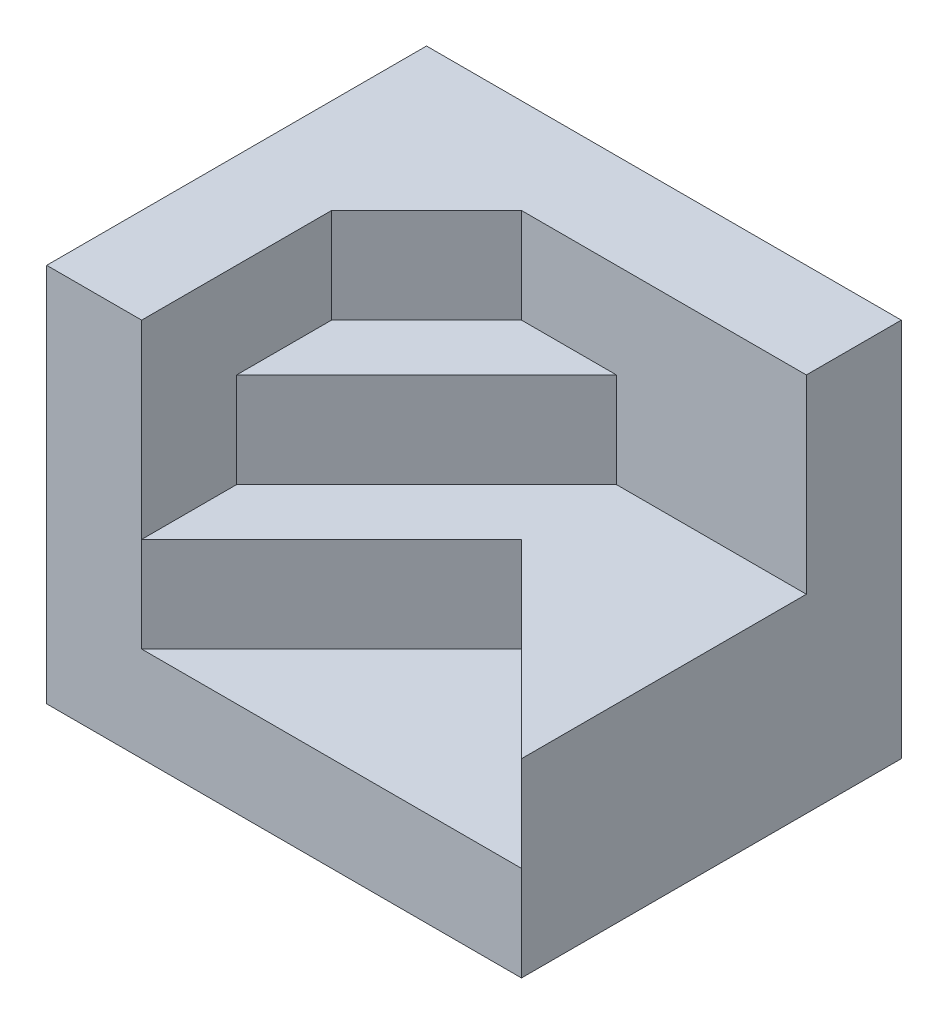
ISO-10303-21;
HEADER;
FILE_DESCRIPTION(('STEP AP214'),'2;1');
FILE_NAME('part.step','',(''),(''),'','','');
FILE_SCHEMA(('AUTOMOTIVE_DESIGN { 1 0 10303 214 1 1 1 1 }'));
ENDSEC;
DATA;
#1=APPLICATION_CONTEXT('core data for automotive mechanical design processes');
#2=APPLICATION_PROTOCOL_DEFINITION('international standard','automotive_design',2000,#1);
#3=PRODUCT_CONTEXT('',#1,'mechanical');
#4=PRODUCT('Part','Part','',(#3));
#5=PRODUCT_RELATED_PRODUCT_CATEGORY('part','',(#4));
#6=PRODUCT_DEFINITION_FORMATION('','',#4);
#7=PRODUCT_DEFINITION_CONTEXT('part definition',#1,'design');
#8=PRODUCT_DEFINITION('design','',#6,#7);
#9=PRODUCT_DEFINITION_SHAPE('','',#8);
#10=(LENGTH_UNIT() NAMED_UNIT(*) SI_UNIT(.MILLI.,.METRE.));
#11=(NAMED_UNIT(*) PLANE_ANGLE_UNIT() SI_UNIT($,.RADIAN.));
#12=(NAMED_UNIT(*) SI_UNIT($,.STERADIAN.) SOLID_ANGLE_UNIT());
#13=UNCERTAINTY_MEASURE_WITH_UNIT(LENGTH_MEASURE(1.E-05),#10,'distance_accuracy_value','');
#14=(GEOMETRIC_REPRESENTATION_CONTEXT(3) GLOBAL_UNCERTAINTY_ASSIGNED_CONTEXT((#13)) GLOBAL_UNIT_ASSIGNED_CONTEXT((#10,
#11,#12)) REPRESENTATION_CONTEXT('',''));
#15=CARTESIAN_POINT('',(0.,0.,0.));
#16=DIRECTION('',(0.,0.,1.));
#17=DIRECTION('',(1.,0.,0.));
#18=AXIS2_PLACEMENT_3D('',#15,#16,#17);
#19=CARTESIAN_POINT('',(0.,10.,0.));
#20=DIRECTION('',(0.,0.,1.));
#21=DIRECTION('',(1.,0.,0.));
#22=AXIS2_PLACEMENT_3D('',#19,#20,#21);
#23=PLANE('',#22);
#24=DIRECTION('',(-1.,0.,0.));
#25=VECTOR('',#24,1.);
#26=CARTESIAN_POINT('',(0.,0.,0.));
#27=LINE('',#26,#25);
#28=CARTESIAN_POINT('',(50.,0.,0.));
#29=VERTEX_POINT('',#28);
#30=CARTESIAN_POINT('',(0.,0.,0.));
#31=VERTEX_POINT('',#30);
#32=EDGE_CURVE('E191',#29,#31,#27,.T.);
#33=ORIENTED_EDGE('',*,*,#32,.F.);
#34=DIRECTION('',(0.,-1.,0.));
#35=VECTOR('',#34,1.);
#36=CARTESIAN_POINT('',(50.,10.,0.));
#37=LINE('',#36,#35);
#38=CARTESIAN_POINT('',(50.,10.,0.));
#39=VERTEX_POINT('',#38);
#40=EDGE_CURVE('E11',#39,#29,#37,.T.);
#41=ORIENTED_EDGE('',*,*,#40,.F.);
#42=DIRECTION('',(-1.,0.,0.));
#43=VECTOR('',#42,1.);
#44=CARTESIAN_POINT('',(0.,10.,0.));
#45=LINE('',#44,#43);
#46=CARTESIAN_POINT('',(10.,10.,0.));
#47=VERTEX_POINT('',#46);
#48=EDGE_CURVE('E40',#39,#47,#45,.T.);
#49=ORIENTED_EDGE('',*,*,#48,.T.);
#50=DIRECTION('',(0.,-1.,0.));
#51=VECTOR('',#50,1.);
#52=CARTESIAN_POINT('',(10.,20.,0.));
#53=LINE('',#52,#51);
#54=CARTESIAN_POINT('',(10.,20.,0.));
#55=VERTEX_POINT('',#54);
#56=EDGE_CURVE('E183',#55,#47,#53,.T.);
#57=ORIENTED_EDGE('',*,*,#56,.F.);
#58=DIRECTION('',(0.,-1.,0.));
#59=VECTOR('',#58,1.);
#60=CARTESIAN_POINT('',(10.,40.,0.));
#61=LINE('',#60,#59);
#62=CARTESIAN_POINT('',(10.,40.,0.));
#63=VERTEX_POINT('',#62);
#64=EDGE_CURVE('E210',#63,#55,#61,.T.);
#65=ORIENTED_EDGE('',*,*,#64,.F.);
#66=DIRECTION('',(-1.,0.,0.));
#67=VECTOR('',#66,1.);
#68=CARTESIAN_POINT('',(0.,40.,0.));
#69=LINE('',#68,#67);
#70=CARTESIAN_POINT('',(0.,40.,0.));
#71=VERTEX_POINT('',#70);
#72=EDGE_CURVE('E205',#63,#71,#69,.T.);
#73=ORIENTED_EDGE('',*,*,#72,.T.);
#74=DIRECTION('',(0.,-1.,0.));
#75=VECTOR('',#74,1.);
#76=CARTESIAN_POINT('',(0.,40.,0.));
#77=LINE('',#76,#75);
#78=EDGE_CURVE('E204',#71,#31,#77,.T.);
#79=ORIENTED_EDGE('',*,*,#78,.T.);
#80=EDGE_LOOP('',(#33,#41,#49,#57,#65,#73,#79));
#81=FACE_BOUND('',#80,.T.);
#82=ADVANCED_FACE('F33',(#81),#23,.T.);
#83=CARTESIAN_POINT('',(0.,10.,0.));
#84=DIRECTION('',(0.,1.,0.));
#85=DIRECTION('',(0.,0.,1.));
#86=AXIS2_PLACEMENT_3D('',#83,#84,#85);
#87=PLANE('',#86);
#88=DIRECTION('',(0.707106781186551,0.,0.707106781186544));
#89=VECTOR('',#88,1.);
#90=CARTESIAN_POINT('',(24.9999999999997,10.,-25.));
#91=LINE('',#90,#89);
#92=CARTESIAN_POINT('',(29.9999999999998,10.,-20.));
#93=VERTEX_POINT('',#92);
#94=EDGE_CURVE('E192',#93,#39,#91,.T.);
#95=ORIENTED_EDGE('',*,*,#94,.F.);
#96=DIRECTION('',(0.707106781186551,0.,-0.707106781186544));
#97=VECTOR('',#96,1.);
#98=CARTESIAN_POINT('',(4.99999999999974,10.,4.99999999999979));
#99=LINE('',#98,#97);
#100=EDGE_CURVE('E54',#47,#93,#99,.T.);
#101=ORIENTED_EDGE('',*,*,#100,.F.);
#102=ORIENTED_EDGE('',*,*,#48,.F.);
#103=EDGE_LOOP('',(#95,#101,#102));
#104=FACE_BOUND('',#103,.T.);
#105=ADVANCED_FACE('F241',(#104),#87,.T.);
#106=CARTESIAN_POINT('',(0.,0.,0.));
#107=DIRECTION('',(0.,1.,0.));
#108=DIRECTION('',(0.,0.,1.));
#109=AXIS2_PLACEMENT_3D('',#106,#107,#108);
#110=PLANE('',#109);
#111=DIRECTION('',(1.,0.,0.));
#112=VECTOR('',#111,1.);
#113=CARTESIAN_POINT('',(0.,0.,-40.));
#114=LINE('',#113,#112);
#115=CARTESIAN_POINT('',(0.,0.,-40.));
#116=VERTEX_POINT('',#115);
#117=CARTESIAN_POINT('',(50.,0.,-40.));
#118=VERTEX_POINT('',#117);
#119=EDGE_CURVE('E214',#116,#118,#114,.T.);
#120=ORIENTED_EDGE('',*,*,#119,.T.);
#121=DIRECTION('',(0.,0.,1.));
#122=VECTOR('',#121,1.);
#123=CARTESIAN_POINT('',(50.,0.,0.));
#124=LINE('',#123,#122);
#125=EDGE_CURVE('E47',#118,#29,#124,.T.);
#126=ORIENTED_EDGE('',*,*,#125,.T.);
#127=ORIENTED_EDGE('',*,*,#32,.T.);
#128=DIRECTION('',(0.,0.,-1.));
#129=VECTOR('',#128,1.);
#130=CARTESIAN_POINT('',(0.,0.,0.));
#131=LINE('',#130,#129);
#132=EDGE_CURVE('E144',#31,#116,#131,.T.);
#133=ORIENTED_EDGE('',*,*,#132,.T.);
#134=EDGE_LOOP('',(#120,#126,#127,#133));
#135=FACE_BOUND('',#134,.T.);
#136=ADVANCED_FACE('F199',(#135),#110,.F.);
#137=CARTESIAN_POINT('',(4.99999999999974,20.,4.99999999999979));
#138=DIRECTION('',(-0.707106781186544,0.,-0.707106781186551));
#139=DIRECTION('',(-0.707106781186551,0.,0.707106781186544));
#140=AXIS2_PLACEMENT_3D('',#137,#138,#139);
#141=PLANE('',#140);
#142=ORIENTED_EDGE('',*,*,#100,.T.);
#143=DIRECTION('',(0.,-1.,0.));
#144=VECTOR('',#143,1.);
#145=CARTESIAN_POINT('',(29.9999999999998,20.,-20.));
#146=LINE('',#145,#144);
#147=CARTESIAN_POINT('',(29.9999999999998,20.,-20.));
#148=VERTEX_POINT('',#147);
#149=EDGE_CURVE('E189',#148,#93,#146,.T.);
#150=ORIENTED_EDGE('',*,*,#149,.F.);
#151=DIRECTION('',(0.707106781186551,0.,-0.707106781186544));
#152=VECTOR('',#151,1.);
#153=CARTESIAN_POINT('',(4.99999999999974,20.,4.99999999999979));
#154=LINE('',#153,#152);
#155=EDGE_CURVE('E167',#55,#148,#154,.T.);
#156=ORIENTED_EDGE('',*,*,#155,.F.);
#157=ORIENTED_EDGE('',*,*,#56,.T.);
#158=EDGE_LOOP('',(#142,#150,#156,#157));
#159=FACE_BOUND('',#158,.T.);
#160=ADVANCED_FACE('F244',(#159),#141,.F.);
#161=CARTESIAN_POINT('',(24.9999999999997,20.,-25.));
#162=DIRECTION('',(0.707106781186544,0.,-0.707106781186551));
#163=DIRECTION('',(-0.707106781186551,0.,-0.707106781186544));
#164=AXIS2_PLACEMENT_3D('',#161,#162,#163);
#165=PLANE('',#164);
#166=ORIENTED_EDGE('',*,*,#94,.T.);
#167=DIRECTION('',(0.,-1.,0.));
#168=VECTOR('',#167,1.);
#169=CARTESIAN_POINT('',(50.,20.,0.));
#170=LINE('',#169,#168);
#171=CARTESIAN_POINT('',(50.,20.,0.));
#172=VERTEX_POINT('',#171);
#173=EDGE_CURVE('E186',#172,#39,#170,.T.);
#174=ORIENTED_EDGE('',*,*,#173,.F.);
#175=DIRECTION('',(0.707106781186551,0.,0.707106781186544));
#176=VECTOR('',#175,1.);
#177=CARTESIAN_POINT('',(24.9999999999997,20.,-25.));
#178=LINE('',#177,#176);
#179=EDGE_CURVE('E170',#148,#172,#178,.T.);
#180=ORIENTED_EDGE('',*,*,#179,.F.);
#181=ORIENTED_EDGE('',*,*,#149,.T.);
#182=EDGE_LOOP('',(#166,#174,#180,#181));
#183=FACE_BOUND('',#182,.T.);
#184=ADVANCED_FACE('F243',(#183),#165,.F.);
#185=CARTESIAN_POINT('',(50.,20.,0.));
#186=DIRECTION('',(1.,0.,0.));
#187=DIRECTION('',(0.,0.,-1.));
#188=AXIS2_PLACEMENT_3D('',#185,#186,#187);
#189=PLANE('',#188);
#190=ORIENTED_EDGE('',*,*,#125,.F.);
#191=DIRECTION('',(0.,-1.,0.));
#192=VECTOR('',#191,1.);
#193=CARTESIAN_POINT('',(50.,40.,-40.));
#194=LINE('',#193,#192);
#195=CARTESIAN_POINT('',(50.,40.,-40.));
#196=VERTEX_POINT('',#195);
#197=EDGE_CURVE('E153',#196,#118,#194,.T.);
#198=ORIENTED_EDGE('',*,*,#197,.F.);
#199=DIRECTION('',(0.,0.,1.));
#200=VECTOR('',#199,1.);
#201=CARTESIAN_POINT('',(50.,40.,0.));
#202=LINE('',#201,#200);
#203=CARTESIAN_POINT('',(50.,40.,-30.));
#204=VERTEX_POINT('',#203);
#205=EDGE_CURVE('E133',#196,#204,#202,.T.);
#206=ORIENTED_EDGE('',*,*,#205,.T.);
#207=DIRECTION('',(0.,-1.,0.));
#208=VECTOR('',#207,1.);
#209=CARTESIAN_POINT('',(50.,40.,-30.));
#210=LINE('',#209,#208);
#211=CARTESIAN_POINT('',(50.,20.,-30.));
#212=VERTEX_POINT('',#211);
#213=EDGE_CURVE('E129',#204,#212,#210,.T.);
#214=ORIENTED_EDGE('',*,*,#213,.T.);
#215=DIRECTION('',(0.,0.,1.));
#216=VECTOR('',#215,1.);
#217=CARTESIAN_POINT('',(50.,20.,0.));
#218=LINE('',#217,#216);
#219=EDGE_CURVE('E172',#212,#172,#218,.T.);
#220=ORIENTED_EDGE('',*,*,#219,.T.);
#221=ORIENTED_EDGE('',*,*,#173,.T.);
#222=ORIENTED_EDGE('',*,*,#40,.T.);
#223=EDGE_LOOP('',(#190,#198,#206,#214,#220,#221,#222));
#224=FACE_BOUND('',#223,.T.);
#225=ADVANCED_FACE('F230',(#224),#189,.T.);
#226=CARTESIAN_POINT('',(0.,20.,0.));
#227=DIRECTION('',(0.,1.,0.));
#228=DIRECTION('',(0.,0.,1.));
#229=AXIS2_PLACEMENT_3D('',#226,#227,#228);
#230=PLANE('',#229);
#231=ORIENTED_EDGE('',*,*,#155,.T.);
#232=ORIENTED_EDGE('',*,*,#179,.T.);
#233=ORIENTED_EDGE('',*,*,#219,.F.);
#234=DIRECTION('',(1.,0.,0.));
#235=VECTOR('',#234,1.);
#236=CARTESIAN_POINT('',(0.,20.,-30.));
#237=LINE('',#236,#235);
#238=CARTESIAN_POINT('',(30.,20.,-30.));
#239=VERTEX_POINT('',#238);
#240=EDGE_CURVE('E175',#239,#212,#237,.T.);
#241=ORIENTED_EDGE('',*,*,#240,.F.);
#242=DIRECTION('',(-0.707106781186547,0.,0.707106781186548));
#243=VECTOR('',#242,1.);
#244=CARTESIAN_POINT('',(0.,20.,0.));
#245=LINE('',#244,#243);
#246=CARTESIAN_POINT('',(10.,20.,-9.99999999999999));
#247=VERTEX_POINT('',#246);
#248=EDGE_CURVE('E177',#239,#247,#245,.T.);
#249=ORIENTED_EDGE('',*,*,#248,.T.);
#250=DIRECTION('',(0.,0.,-1.));
#251=VECTOR('',#250,1.);
#252=CARTESIAN_POINT('',(10.,20.,0.));
#253=LINE('',#252,#251);
#254=EDGE_CURVE('E180',#55,#247,#253,.T.);
#255=ORIENTED_EDGE('',*,*,#254,.F.);
#256=EDGE_LOOP('',(#231,#232,#233,#241,#249,#255));
#257=FACE_BOUND('',#256,.T.);
#258=ADVANCED_FACE('F247',(#257),#230,.T.);
#259=CARTESIAN_POINT('',(0.,30.,0.));
#260=DIRECTION('',(0.707106781186548,0.,0.707106781186547));
#261=DIRECTION('',(0.707106781186547,0.,-0.707106781186548));
#262=AXIS2_PLACEMENT_3D('',#259,#260,#261);
#263=PLANE('',#262);
#264=DIRECTION('',(0.,-1.,0.));
#265=VECTOR('',#264,1.);
#266=CARTESIAN_POINT('',(10.,30.,-9.99999999999999));
#267=LINE('',#266,#265);
#268=CARTESIAN_POINT('',(10.,30.,-9.99999999999999));
#269=VERTEX_POINT('',#268);
#270=EDGE_CURVE('E162',#269,#247,#267,.T.);
#271=ORIENTED_EDGE('',*,*,#270,.T.);
#272=ORIENTED_EDGE('',*,*,#248,.F.);
#273=DIRECTION('',(0.,-1.,0.));
#274=VECTOR('',#273,1.);
#275=CARTESIAN_POINT('',(30.,30.,-30.));
#276=LINE('',#275,#274);
#277=CARTESIAN_POINT('',(30.,30.,-30.));
#278=VERTEX_POINT('',#277);
#279=EDGE_CURVE('E164',#278,#239,#276,.T.);
#280=ORIENTED_EDGE('',*,*,#279,.F.);
#281=DIRECTION('',(-0.707106781186547,0.,0.707106781186548));
#282=VECTOR('',#281,1.);
#283=CARTESIAN_POINT('',(0.,30.,0.));
#284=LINE('',#283,#282);
#285=EDGE_CURVE('E149',#278,#269,#284,.T.);
#286=ORIENTED_EDGE('',*,*,#285,.T.);
#287=EDGE_LOOP('',(#271,#272,#280,#286));
#288=FACE_BOUND('',#287,.T.);
#289=ADVANCED_FACE('F257',(#288),#263,.T.);
#290=CARTESIAN_POINT('',(0.,30.,0.));
#291=DIRECTION('',(0.,1.,0.));
#292=DIRECTION('',(0.,0.,1.));
#293=AXIS2_PLACEMENT_3D('',#290,#291,#292);
#294=PLANE('',#293);
#295=ORIENTED_EDGE('',*,*,#285,.F.);
#296=DIRECTION('',(1.,0.,0.));
#297=VECTOR('',#296,1.);
#298=CARTESIAN_POINT('',(0.,30.,-30.));
#299=LINE('',#298,#297);
#300=CARTESIAN_POINT('',(20.,30.,-30.));
#301=VERTEX_POINT('',#300);
#302=EDGE_CURVE('E151',#301,#278,#299,.T.);
#303=ORIENTED_EDGE('',*,*,#302,.F.);
#304=DIRECTION('',(0.707106781186547,0.,-0.707106781186548));
#305=VECTOR('',#304,1.);
#306=CARTESIAN_POINT('',(-5.,30.,-5.));
#307=LINE('',#306,#305);
#308=CARTESIAN_POINT('',(10.,30.,-20.));
#309=VERTEX_POINT('',#308);
#310=EDGE_CURVE('E148',#309,#301,#307,.T.);
#311=ORIENTED_EDGE('',*,*,#310,.F.);
#312=DIRECTION('',(0.,0.,-1.));
#313=VECTOR('',#312,1.);
#314=CARTESIAN_POINT('',(10.,30.,0.));
#315=LINE('',#314,#313);
#316=EDGE_CURVE('E159',#269,#309,#315,.T.);
#317=ORIENTED_EDGE('',*,*,#316,.F.);
#318=EDGE_LOOP('',(#295,#303,#311,#317));
#319=FACE_BOUND('',#318,.T.);
#320=ADVANCED_FACE('F255',(#319),#294,.T.);
#321=CARTESIAN_POINT('',(-5.,40.,-5.));
#322=DIRECTION('',(-0.707106781186548,0.,-0.707106781186547));
#323=DIRECTION('',(-0.707106781186547,0.,0.707106781186548));
#324=AXIS2_PLACEMENT_3D('',#321,#322,#323);
#325=PLANE('',#324);
#326=ORIENTED_EDGE('',*,*,#310,.T.);
#327=DIRECTION('',(0.,-1.,0.));
#328=VECTOR('',#327,1.);
#329=CARTESIAN_POINT('',(20.,40.,-30.));
#330=LINE('',#329,#328);
#331=CARTESIAN_POINT('',(20.,40.,-30.));
#332=VERTEX_POINT('',#331);
#333=EDGE_CURVE('E127',#332,#301,#330,.T.);
#334=ORIENTED_EDGE('',*,*,#333,.F.);
#335=DIRECTION('',(0.707106781186547,0.,-0.707106781186548));
#336=VECTOR('',#335,1.);
#337=CARTESIAN_POINT('',(-5.,40.,-5.));
#338=LINE('',#337,#336);
#339=CARTESIAN_POINT('',(10.,40.,-20.));
#340=VERTEX_POINT('',#339);
#341=EDGE_CURVE('E134',#340,#332,#338,.T.);
#342=ORIENTED_EDGE('',*,*,#341,.F.);
#343=DIRECTION('',(0.,-1.,0.));
#344=VECTOR('',#343,1.);
#345=CARTESIAN_POINT('',(10.,40.,-20.));
#346=LINE('',#345,#344);
#347=EDGE_CURVE('E219',#340,#309,#346,.T.);
#348=ORIENTED_EDGE('',*,*,#347,.T.);
#349=EDGE_LOOP('',(#326,#334,#342,#348));
#350=FACE_BOUND('',#349,.T.);
#351=ADVANCED_FACE('F147',(#350),#325,.F.);
#352=CARTESIAN_POINT('',(0.,40.,-30.));
#353=DIRECTION('',(0.,0.,-1.));
#354=DIRECTION('',(-1.,0.,0.));
#355=AXIS2_PLACEMENT_3D('',#352,#353,#354);
#356=PLANE('',#355);
#357=ORIENTED_EDGE('',*,*,#240,.T.);
#358=ORIENTED_EDGE('',*,*,#213,.F.);
#359=DIRECTION('',(1.,0.,0.));
#360=VECTOR('',#359,1.);
#361=CARTESIAN_POINT('',(0.,40.,-30.));
#362=LINE('',#361,#360);
#363=EDGE_CURVE('E121',#332,#204,#362,.T.);
#364=ORIENTED_EDGE('',*,*,#363,.F.);
#365=ORIENTED_EDGE('',*,*,#333,.T.);
#366=ORIENTED_EDGE('',*,*,#302,.T.);
#367=ORIENTED_EDGE('',*,*,#279,.T.);
#368=EDGE_LOOP('',(#357,#358,#364,#365,#366,#367));
#369=FACE_BOUND('',#368,.T.);
#370=ADVANCED_FACE('F124',(#369),#356,.F.);
#371=CARTESIAN_POINT('',(0.,40.,-40.));
#372=DIRECTION('',(0.,0.,-1.));
#373=DIRECTION('',(-1.,0.,0.));
#374=AXIS2_PLACEMENT_3D('',#371,#372,#373);
#375=PLANE('',#374);
#376=ORIENTED_EDGE('',*,*,#119,.F.);
#377=DIRECTION('',(0.,-1.,0.));
#378=VECTOR('',#377,1.);
#379=CARTESIAN_POINT('',(0.,40.,-40.));
#380=LINE('',#379,#378);
#381=CARTESIAN_POINT('',(0.,40.,-40.));
#382=VERTEX_POINT('',#381);
#383=EDGE_CURVE('E209',#382,#116,#380,.T.);
#384=ORIENTED_EDGE('',*,*,#383,.F.);
#385=DIRECTION('',(1.,0.,0.));
#386=VECTOR('',#385,1.);
#387=CARTESIAN_POINT('',(0.,40.,-40.));
#388=LINE('',#387,#386);
#389=EDGE_CURVE('E228',#382,#196,#388,.T.);
#390=ORIENTED_EDGE('',*,*,#389,.T.);
#391=ORIENTED_EDGE('',*,*,#197,.T.);
#392=EDGE_LOOP('',(#376,#384,#390,#391));
#393=FACE_BOUND('',#392,.T.);
#394=ADVANCED_FACE('F226',(#393),#375,.T.);
#395=CARTESIAN_POINT('',(0.,40.,0.));
#396=DIRECTION('',(-1.,0.,0.));
#397=DIRECTION('',(0.,0.,1.));
#398=AXIS2_PLACEMENT_3D('',#395,#396,#397);
#399=PLANE('',#398);
#400=ORIENTED_EDGE('',*,*,#132,.F.);
#401=ORIENTED_EDGE('',*,*,#78,.F.);
#402=DIRECTION('',(0.,0.,-1.));
#403=VECTOR('',#402,1.);
#404=CARTESIAN_POINT('',(0.,40.,0.));
#405=LINE('',#404,#403);
#406=EDGE_CURVE('E232',#71,#382,#405,.T.);
#407=ORIENTED_EDGE('',*,*,#406,.T.);
#408=ORIENTED_EDGE('',*,*,#383,.T.);
#409=EDGE_LOOP('',(#400,#401,#407,#408));
#410=FACE_BOUND('',#409,.T.);
#411=ADVANCED_FACE('F212',(#410),#399,.T.);
#412=CARTESIAN_POINT('',(10.,40.,0.));
#413=DIRECTION('',(-1.,0.,0.));
#414=DIRECTION('',(0.,0.,1.));
#415=AXIS2_PLACEMENT_3D('',#412,#413,#414);
#416=PLANE('',#415);
#417=ORIENTED_EDGE('',*,*,#254,.T.);
#418=ORIENTED_EDGE('',*,*,#270,.F.);
#419=ORIENTED_EDGE('',*,*,#316,.T.);
#420=ORIENTED_EDGE('',*,*,#347,.F.);
#421=DIRECTION('',(0.,0.,-1.));
#422=VECTOR('',#421,1.);
#423=CARTESIAN_POINT('',(10.,40.,0.));
#424=LINE('',#423,#422);
#425=EDGE_CURVE('E140',#63,#340,#424,.T.);
#426=ORIENTED_EDGE('',*,*,#425,.F.);
#427=ORIENTED_EDGE('',*,*,#64,.T.);
#428=EDGE_LOOP('',(#417,#418,#419,#420,#426,#427));
#429=FACE_BOUND('',#428,.T.);
#430=ADVANCED_FACE('F251',(#429),#416,.F.);
#431=CARTESIAN_POINT('',(0.,40.,0.));
#432=DIRECTION('',(0.,1.,0.));
#433=DIRECTION('',(0.,0.,1.));
#434=AXIS2_PLACEMENT_3D('',#431,#432,#433);
#435=PLANE('',#434);
#436=ORIENTED_EDGE('',*,*,#341,.T.);
#437=ORIENTED_EDGE('',*,*,#363,.T.);
#438=ORIENTED_EDGE('',*,*,#205,.F.);
#439=ORIENTED_EDGE('',*,*,#389,.F.);
#440=ORIENTED_EDGE('',*,*,#406,.F.);
#441=ORIENTED_EDGE('',*,*,#72,.F.);
#442=ORIENTED_EDGE('',*,*,#425,.T.);
#443=EDGE_LOOP('',(#436,#437,#438,#439,#440,#441,#442));
#444=FACE_BOUND('',#443,.T.);
#445=ADVANCED_FACE('F137',(#444),#435,.T.);
#446=CLOSED_SHELL('',(#82,#105,#136,#160,#184,#225,#258,#289,#320,#351,#370,#394,#411,#430,#445));
#447=MANIFOLD_SOLID_BREP('B2',#446);
#448=ADVANCED_BREP_SHAPE_REPRESENTATION('',(#18,#447),#14);
#449=SHAPE_DEFINITION_REPRESENTATION(#9,#448);
ENDSEC;
END-ISO-10303-21;
